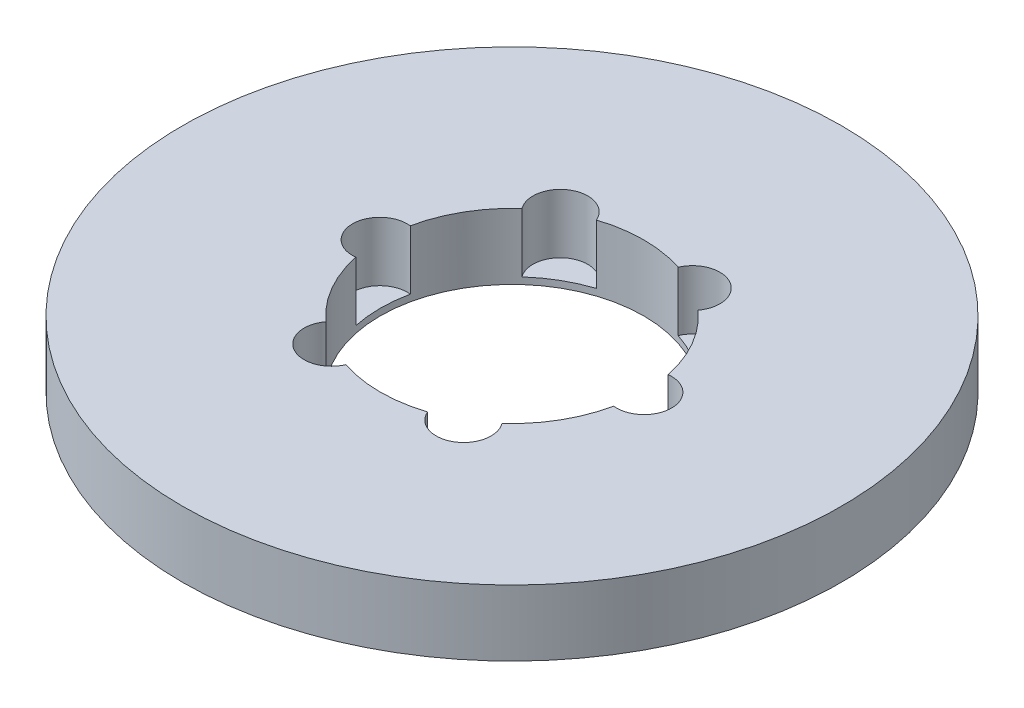
ISO-10303-21;
HEADER;
FILE_DESCRIPTION(('STEP AP214'),'2;1');
FILE_NAME('part.step','',(''),(''),'','','');
FILE_SCHEMA(('AUTOMOTIVE_DESIGN { 1 0 10303 214 1 1 1 1 }'));
ENDSEC;
DATA;
#1=APPLICATION_CONTEXT('core data for automotive mechanical design processes');
#2=APPLICATION_PROTOCOL_DEFINITION('international standard','automotive_design',2000,#1);
#3=PRODUCT_CONTEXT('',#1,'mechanical');
#4=PRODUCT('Part','Part','',(#3));
#5=PRODUCT_RELATED_PRODUCT_CATEGORY('part','',(#4));
#6=PRODUCT_DEFINITION_FORMATION('','',#4);
#7=PRODUCT_DEFINITION_CONTEXT('part definition',#1,'design');
#8=PRODUCT_DEFINITION('design','',#6,#7);
#9=PRODUCT_DEFINITION_SHAPE('','',#8);
#10=(LENGTH_UNIT() NAMED_UNIT(*) SI_UNIT(.MILLI.,.METRE.));
#11=(NAMED_UNIT(*) PLANE_ANGLE_UNIT() SI_UNIT($,.RADIAN.));
#12=(NAMED_UNIT(*) SI_UNIT($,.STERADIAN.) SOLID_ANGLE_UNIT());
#13=UNCERTAINTY_MEASURE_WITH_UNIT(LENGTH_MEASURE(1.E-05),#10,'distance_accuracy_value','');
#14=(GEOMETRIC_REPRESENTATION_CONTEXT(3) GLOBAL_UNCERTAINTY_ASSIGNED_CONTEXT((#13)) GLOBAL_UNIT_ASSIGNED_CONTEXT((#10,
#11,#12)) REPRESENTATION_CONTEXT('',''));
#15=CARTESIAN_POINT('',(0.,0.,0.));
#16=DIRECTION('',(0.,0.,1.));
#17=DIRECTION('',(1.,0.,0.));
#18=AXIS2_PLACEMENT_3D('',#15,#16,#17);
#19=CARTESIAN_POINT('',(0.,15.,0.));
#20=DIRECTION('',(0.,-1.,0.));
#21=DIRECTION('',(0.,0.,-1.));
#22=AXIS2_PLACEMENT_3D('',#19,#20,#21);
#23=CYLINDRICAL_SURFACE('',#22,75.);
#24=CARTESIAN_POINT('',(0.,15.,0.));
#25=DIRECTION('',(0.,1.,0.));
#26=DIRECTION('',(0.,0.,1.));
#27=AXIS2_PLACEMENT_3D('',#24,#25,#26);
#28=CIRCLE('',#27,75.);
#29=CARTESIAN_POINT('',(0.,15.,75.));
#30=VERTEX_POINT('',#29);
#31=EDGE_CURVE('E171',#30,#30,#28,.T.);
#32=ORIENTED_EDGE('',*,*,#31,.F.);
#33=EDGE_LOOP('',(#32));
#34=FACE_BOUND('',#33,.T.);
#35=CARTESIAN_POINT('',(0.,0.,0.));
#36=DIRECTION('',(0.,1.,0.));
#37=DIRECTION('',(0.,0.,1.));
#38=AXIS2_PLACEMENT_3D('',#35,#36,#37);
#39=CIRCLE('',#38,75.);
#40=CARTESIAN_POINT('',(0.,0.,75.));
#41=VERTEX_POINT('',#40);
#42=EDGE_CURVE('E157',#41,#41,#39,.T.);
#43=ORIENTED_EDGE('',*,*,#42,.T.);
#44=EDGE_LOOP('',(#43));
#45=FACE_BOUND('',#44,.T.);
#46=ADVANCED_FACE('F39',(#34,#45),#23,.T.);
#47=CARTESIAN_POINT('',(0.,15.,0.));
#48=DIRECTION('',(0.,1.,0.));
#49=DIRECTION('',(0.,0.,1.));
#50=AXIS2_PLACEMENT_3D('',#47,#48,#49);
#51=PLANE('',#50);
#52=CARTESIAN_POINT('',(-15.0317045543741,15.,-26.0356760125397));
#53=DIRECTION('',(0.,1.,0.));
#54=DIRECTION('',(-0.866025403784433,0.,0.50000000000001));
#55=AXIS2_PLACEMENT_3D('',#52,#53,#54);
#56=CIRCLE('',#55,6.24633584145181);
#57=CARTESIAN_POINT('',(-9.30137681088265,15.,-28.5216477332915));
#58=VERTEX_POINT('',#57);
#59=CARTESIAN_POINT('',(-20.0497830893805,15.,-22.3160524750412));
#60=VERTEX_POINT('',#59);
#61=EDGE_CURVE('E214',#58,#60,#56,.T.);
#62=ORIENTED_EDGE('',*,*,#61,.F.);
#63=CARTESIAN_POINT('',(0.,15.,0.));
#64=DIRECTION('',(0.,1.,0.));
#65=DIRECTION('',(0.,0.,1.));
#66=AXIS2_PLACEMENT_3D('',#63,#64,#65);
#67=CIRCLE('',#66,30.);
#68=CARTESIAN_POINT('',(9.30137681088206,15.,-28.5216477332917));
#69=VERTEX_POINT('',#68);
#70=EDGE_CURVE('E272',#69,#58,#67,.T.);
#71=ORIENTED_EDGE('',*,*,#70,.F.);
#72=CARTESIAN_POINT('',(15.0317045543736,15.,-26.0356760125401));
#73=DIRECTION('',(0.,1.,0.));
#74=DIRECTION('',(-0.866025403784443,0.,-0.499999999999992));
#75=AXIS2_PLACEMENT_3D('',#72,#73,#74);
#76=CIRCLE('',#75,6.24633584145181);
#77=CARTESIAN_POINT('',(20.04978308938,15.,-22.3160524750416));
#78=VERTEX_POINT('',#77);
#79=EDGE_CURVE('E285',#78,#69,#76,.T.);
#80=ORIENTED_EDGE('',*,*,#79,.F.);
#81=CARTESIAN_POINT('',(29.3511599002626,15.,-6.20559525825025));
#82=VERTEX_POINT('',#81);
#83=EDGE_CURVE('E165',#82,#78,#67,.T.);
#84=ORIENTED_EDGE('',*,*,#83,.F.);
#85=CARTESIAN_POINT('',(30.0634091087476,15.,0.));
#86=DIRECTION('',(0.,1.,0.));
#87=DIRECTION('',(0.,0.,-1.));
#88=AXIS2_PLACEMENT_3D('',#85,#86,#87);
#89=CIRCLE('',#88,6.24633584145181);
#90=CARTESIAN_POINT('',(29.3511599002626,15.,6.20559525825025));
#91=VERTEX_POINT('',#90);
#92=EDGE_CURVE('E281',#91,#82,#89,.T.);
#93=ORIENTED_EDGE('',*,*,#92,.F.);
#94=CARTESIAN_POINT('',(20.0497830893804,15.,22.3160524750413));
#95=VERTEX_POINT('',#94);
#96=EDGE_CURVE('E160',#95,#91,#67,.T.);
#97=ORIENTED_EDGE('',*,*,#96,.F.);
#98=CARTESIAN_POINT('',(15.0317045543739,15.,26.0356760125399));
#99=DIRECTION('',(0.,1.,0.));
#100=DIRECTION('',(0.866025403784436,0.,-0.500000000000004));
#101=AXIS2_PLACEMENT_3D('',#98,#99,#100);
#102=CIRCLE('',#101,6.24633584145181);
#103=CARTESIAN_POINT('',(9.30137681088245,15.,28.5216477332916));
#104=VERTEX_POINT('',#103);
#105=EDGE_CURVE('E154',#104,#95,#102,.T.);
#106=ORIENTED_EDGE('',*,*,#105,.F.);
#107=CARTESIAN_POINT('',(-9.30137681088225,15.,28.5216477332917));
#108=VERTEX_POINT('',#107);
#109=EDGE_CURVE('E150',#108,#104,#67,.T.);
#110=ORIENTED_EDGE('',*,*,#109,.F.);
#111=CARTESIAN_POINT('',(-15.0317045543737,15.,26.03567601254));
#112=DIRECTION('',(0.,1.,0.));
#113=DIRECTION('',(0.86602540378444,0.,0.499999999999998));
#114=AXIS2_PLACEMENT_3D('',#111,#112,#113);
#115=CIRCLE('',#114,6.24633584145181);
#116=CARTESIAN_POINT('',(-20.0497830893802,15.,22.3160524750414));
#117=VERTEX_POINT('',#116);
#118=EDGE_CURVE('E127',#117,#108,#115,.T.);
#119=ORIENTED_EDGE('',*,*,#118,.F.);
#120=CARTESIAN_POINT('',(-29.3511599002626,15.,6.20559525825025));
#121=VERTEX_POINT('',#120);
#122=EDGE_CURVE('E156',#121,#117,#67,.T.);
#123=ORIENTED_EDGE('',*,*,#122,.F.);
#124=CARTESIAN_POINT('',(-30.0634091087476,15.,0.));
#125=DIRECTION('',(0.,1.,0.));
#126=DIRECTION('',(0.,0.,1.));
#127=AXIS2_PLACEMENT_3D('',#124,#125,#126);
#128=CIRCLE('',#127,6.24633584145181);
#129=CARTESIAN_POINT('',(-29.3511599002626,15.,-6.20559525825025));
#130=VERTEX_POINT('',#129);
#131=EDGE_CURVE('E164',#130,#121,#128,.T.);
#132=ORIENTED_EDGE('',*,*,#131,.F.);
#133=EDGE_CURVE('E159',#60,#130,#67,.T.);
#134=ORIENTED_EDGE('',*,*,#133,.F.);
#135=EDGE_LOOP('',(#62,#71,#80,#84,#93,#97,#106,#110,#119,#123,#132,#134));
#136=FACE_BOUND('',#135,.T.);
#137=ORIENTED_EDGE('',*,*,#31,.T.);
#138=EDGE_LOOP('',(#137));
#139=FACE_BOUND('',#138,.T.);
#140=ADVANCED_FACE('F155',(#136,#139),#51,.T.);
#141=CARTESIAN_POINT('',(0.,0.,0.));
#142=DIRECTION('',(0.,1.,0.));
#143=DIRECTION('',(0.,0.,1.));
#144=AXIS2_PLACEMENT_3D('',#141,#142,#143);
#145=PLANE('',#144);
#146=CARTESIAN_POINT('',(0.,0.,0.));
#147=DIRECTION('',(0.,1.,0.));
#148=DIRECTION('',(0.,0.,1.));
#149=AXIS2_PLACEMENT_3D('',#146,#147,#148);
#150=CIRCLE('',#149,30.);
#151=CARTESIAN_POINT('',(0.,0.,30.));
#152=VERTEX_POINT('',#151);
#153=EDGE_CURVE('E170',#152,#152,#150,.T.);
#154=ORIENTED_EDGE('',*,*,#153,.T.);
#155=EDGE_LOOP('',(#154));
#156=FACE_BOUND('',#155,.T.);
#157=ORIENTED_EDGE('',*,*,#42,.F.);
#158=EDGE_LOOP('',(#157));
#159=FACE_BOUND('',#158,.T.);
#160=ADVANCED_FACE('F232',(#156,#159),#145,.F.);
#161=CARTESIAN_POINT('',(0.,15.,0.));
#162=DIRECTION('',(0.,-1.,0.));
#163=DIRECTION('',(0.,0.,-1.));
#164=AXIS2_PLACEMENT_3D('',#161,#162,#163);
#165=CYLINDRICAL_SURFACE('',#164,30.);
#166=DIRECTION('',(0.,1.,0.));
#167=VECTOR('',#166,1.);
#168=CARTESIAN_POINT('',(-9.30137681088265,8.25850928202004,-28.5216477332915));
#169=LINE('',#168,#167);
#170=CARTESIAN_POINT('',(-9.30137681088265,1.51701856404009,-28.5216477332915));
#171=VERTEX_POINT('',#170);
#172=EDGE_CURVE('E11',#171,#58,#169,.T.);
#173=ORIENTED_EDGE('',*,*,#172,.F.);
#174=CARTESIAN_POINT('',(0.,1.51701856404009,0.));
#175=DIRECTION('',(0.,1.,0.));
#176=DIRECTION('',(0.,0.,1.));
#177=AXIS2_PLACEMENT_3D('',#174,#175,#176);
#178=CIRCLE('',#177,30.);
#179=CARTESIAN_POINT('',(-20.0497830893805,1.51701856404009,-22.3160524750412));
#180=VERTEX_POINT('',#179);
#181=EDGE_CURVE('E209',#171,#180,#178,.T.);
#182=ORIENTED_EDGE('',*,*,#181,.T.);
#183=DIRECTION('',(0.,1.,0.));
#184=VECTOR('',#183,1.);
#185=CARTESIAN_POINT('',(-20.0497830893805,8.25850928202004,-22.3160524750412));
#186=LINE('',#185,#184);
#187=EDGE_CURVE('E46',#60,#180,#186,.F.);
#188=ORIENTED_EDGE('',*,*,#187,.F.);
#189=ORIENTED_EDGE('',*,*,#133,.T.);
#190=DIRECTION('',(0.,1.,0.));
#191=VECTOR('',#190,1.);
#192=CARTESIAN_POINT('',(-29.3511599002626,8.25850928202004,-6.20559525825025));
#193=LINE('',#192,#191);
#194=CARTESIAN_POINT('',(-29.3511599002626,1.51701856404009,-6.20559525825025));
#195=VERTEX_POINT('',#194);
#196=EDGE_CURVE('E185',#195,#130,#193,.T.);
#197=ORIENTED_EDGE('',*,*,#196,.F.);
#198=CARTESIAN_POINT('',(0.,1.51701856404009,0.));
#199=DIRECTION('',(0.,1.,0.));
#200=DIRECTION('',(0.,0.,1.));
#201=AXIS2_PLACEMENT_3D('',#198,#199,#200);
#202=CIRCLE('',#201,30.);
#203=CARTESIAN_POINT('',(-29.3511599002626,1.51701856404009,6.20559525825025));
#204=VERTEX_POINT('',#203);
#205=EDGE_CURVE('E173',#195,#204,#202,.T.);
#206=ORIENTED_EDGE('',*,*,#205,.T.);
#207=DIRECTION('',(0.,1.,0.));
#208=VECTOR('',#207,1.);
#209=CARTESIAN_POINT('',(-29.3511599002626,8.25850928202004,6.20559525825025));
#210=LINE('',#209,#208);
#211=EDGE_CURVE('E178',#121,#204,#210,.F.);
#212=ORIENTED_EDGE('',*,*,#211,.F.);
#213=ORIENTED_EDGE('',*,*,#122,.T.);
#214=DIRECTION('',(0.,1.,0.));
#215=VECTOR('',#214,1.);
#216=CARTESIAN_POINT('',(-20.0497830893802,8.25850928202004,22.3160524750414));
#217=LINE('',#216,#215);
#218=CARTESIAN_POINT('',(-20.0497830893802,1.51701856404009,22.3160524750414));
#219=VERTEX_POINT('',#218);
#220=EDGE_CURVE('E132',#219,#117,#217,.T.);
#221=ORIENTED_EDGE('',*,*,#220,.F.);
#222=CARTESIAN_POINT('',(0.,1.51701856404009,0.));
#223=DIRECTION('',(0.,1.,0.));
#224=DIRECTION('',(0.,0.,1.));
#225=AXIS2_PLACEMENT_3D('',#222,#223,#224);
#226=CIRCLE('',#225,30.);
#227=CARTESIAN_POINT('',(-9.30137681088225,1.51701856404009,28.5216477332917));
#228=VERTEX_POINT('',#227);
#229=EDGE_CURVE('E146',#219,#228,#226,.T.);
#230=ORIENTED_EDGE('',*,*,#229,.T.);
#231=DIRECTION('',(0.,1.,0.));
#232=VECTOR('',#231,1.);
#233=CARTESIAN_POINT('',(-9.30137681088225,8.25850928202004,28.5216477332917));
#234=LINE('',#233,#232);
#235=EDGE_CURVE('E128',#108,#228,#234,.F.);
#236=ORIENTED_EDGE('',*,*,#235,.F.);
#237=ORIENTED_EDGE('',*,*,#109,.T.);
#238=DIRECTION('',(0.,1.,0.));
#239=VECTOR('',#238,1.);
#240=CARTESIAN_POINT('',(9.30137681088245,8.25850928202004,28.5216477332916));
#241=LINE('',#240,#239);
#242=CARTESIAN_POINT('',(9.30137681088245,1.51701856404009,28.5216477332916));
#243=VERTEX_POINT('',#242);
#244=EDGE_CURVE('E192',#243,#104,#241,.T.);
#245=ORIENTED_EDGE('',*,*,#244,.F.);
#246=CARTESIAN_POINT('',(0.,1.51701856404009,0.));
#247=DIRECTION('',(0.,1.,0.));
#248=DIRECTION('',(0.,0.,1.));
#249=AXIS2_PLACEMENT_3D('',#246,#247,#248);
#250=CIRCLE('',#249,30.);
#251=CARTESIAN_POINT('',(20.0497830893804,1.51701856404009,22.3160524750413));
#252=VERTEX_POINT('',#251);
#253=EDGE_CURVE('E190',#243,#252,#250,.T.);
#254=ORIENTED_EDGE('',*,*,#253,.T.);
#255=DIRECTION('',(0.,1.,0.));
#256=VECTOR('',#255,1.);
#257=CARTESIAN_POINT('',(20.0497830893804,8.25850928202004,22.3160524750413));
#258=LINE('',#257,#256);
#259=EDGE_CURVE('E189',#95,#252,#258,.F.);
#260=ORIENTED_EDGE('',*,*,#259,.F.);
#261=ORIENTED_EDGE('',*,*,#96,.T.);
#262=DIRECTION('',(0.,1.,0.));
#263=VECTOR('',#262,1.);
#264=CARTESIAN_POINT('',(29.3511599002626,8.25850928202004,6.20559525825025));
#265=LINE('',#264,#263);
#266=CARTESIAN_POINT('',(29.3511599002626,1.51701856404009,6.20559525825025));
#267=VERTEX_POINT('',#266);
#268=EDGE_CURVE('E203',#267,#91,#265,.T.);
#269=ORIENTED_EDGE('',*,*,#268,.F.);
#270=CARTESIAN_POINT('',(0.,1.51701856404009,0.));
#271=DIRECTION('',(0.,1.,0.));
#272=DIRECTION('',(0.,0.,1.));
#273=AXIS2_PLACEMENT_3D('',#270,#271,#272);
#274=CIRCLE('',#273,30.);
#275=CARTESIAN_POINT('',(29.3511599002626,1.51701856404009,-6.20559525825025));
#276=VERTEX_POINT('',#275);
#277=EDGE_CURVE('E194',#267,#276,#274,.T.);
#278=ORIENTED_EDGE('',*,*,#277,.T.);
#279=DIRECTION('',(0.,1.,0.));
#280=VECTOR('',#279,1.);
#281=CARTESIAN_POINT('',(29.3511599002626,8.25850928202004,-6.20559525825025));
#282=LINE('',#281,#280);
#283=EDGE_CURVE('E196',#82,#276,#282,.F.);
#284=ORIENTED_EDGE('',*,*,#283,.F.);
#285=ORIENTED_EDGE('',*,*,#83,.T.);
#286=DIRECTION('',(0.,1.,0.));
#287=VECTOR('',#286,1.);
#288=CARTESIAN_POINT('',(20.04978308938,8.25850928202004,-22.3160524750416));
#289=LINE('',#288,#287);
#290=CARTESIAN_POINT('',(20.04978308938,1.51701856404009,-22.3160524750416));
#291=VERTEX_POINT('',#290);
#292=EDGE_CURVE('E208',#291,#78,#289,.T.);
#293=ORIENTED_EDGE('',*,*,#292,.F.);
#294=CARTESIAN_POINT('',(0.,1.51701856404009,0.));
#295=DIRECTION('',(0.,1.,0.));
#296=DIRECTION('',(0.,0.,1.));
#297=AXIS2_PLACEMENT_3D('',#294,#295,#296);
#298=CIRCLE('',#297,30.);
#299=CARTESIAN_POINT('',(9.30137681088206,1.51701856404009,-28.5216477332917));
#300=VERTEX_POINT('',#299);
#301=EDGE_CURVE('E201',#291,#300,#298,.T.);
#302=ORIENTED_EDGE('',*,*,#301,.T.);
#303=DIRECTION('',(0.,1.,0.));
#304=VECTOR('',#303,1.);
#305=CARTESIAN_POINT('',(9.30137681088206,8.25850928202004,-28.5216477332917));
#306=LINE('',#305,#304);
#307=EDGE_CURVE('E206',#69,#300,#306,.F.);
#308=ORIENTED_EDGE('',*,*,#307,.F.);
#309=ORIENTED_EDGE('',*,*,#70,.T.);
#310=EDGE_LOOP('',(#173,#182,#188,#189,#197,#206,#212,#213,#221,#230,#236,#237,#245,#254,#260,
#261,#269,#278,#284,#285,#293,#302,#308,#309));
#311=FACE_BOUND('',#310,.T.);
#312=ORIENTED_EDGE('',*,*,#153,.F.);
#313=EDGE_LOOP('',(#312));
#314=FACE_BOUND('',#313,.T.);
#315=ADVANCED_FACE('F145',(#311,#314),#165,.F.);
#316=CARTESIAN_POINT('',(-30.0634091087476,1.51701856404009,0.));
#317=DIRECTION('',(0.,1.,0.));
#318=DIRECTION('',(0.,0.,1.));
#319=AXIS2_PLACEMENT_3D('',#316,#317,#318);
#320=CYLINDRICAL_SURFACE('',#319,6.24633584145181);
#321=ORIENTED_EDGE('',*,*,#196,.T.);
#322=ORIENTED_EDGE('',*,*,#131,.T.);
#323=ORIENTED_EDGE('',*,*,#211,.T.);
#324=CARTESIAN_POINT('',(-30.0634091087476,1.51701856404009,0.));
#325=DIRECTION('',(0.,1.,0.));
#326=DIRECTION('',(0.,0.,1.));
#327=AXIS2_PLACEMENT_3D('',#324,#325,#326);
#328=CIRCLE('',#327,6.24633584145181);
#329=EDGE_CURVE('E168',#195,#204,#328,.T.);
#330=ORIENTED_EDGE('',*,*,#329,.F.);
#331=EDGE_LOOP('',(#321,#322,#323,#330));
#332=FACE_BOUND('',#331,.T.);
#333=ADVANCED_FACE('F243',(#332),#320,.F.);
#334=CARTESIAN_POINT('',(-30.0634091087476,1.51701856404009,0.));
#335=DIRECTION('',(0.,1.,0.));
#336=DIRECTION('',(0.,0.,1.));
#337=AXIS2_PLACEMENT_3D('',#334,#335,#336);
#338=PLANE('',#337);
#339=ORIENTED_EDGE('',*,*,#329,.T.);
#340=ORIENTED_EDGE('',*,*,#205,.F.);
#341=EDGE_LOOP('',(#339,#340));
#342=FACE_BOUND('',#341,.T.);
#343=ADVANCED_FACE('F247',(#342),#338,.T.);
#344=CARTESIAN_POINT('',(-15.0317045543737,1.51701856404009,26.03567601254));
#345=DIRECTION('',(0.,1.,0.));
#346=DIRECTION('',(0.,0.,1.));
#347=AXIS2_PLACEMENT_3D('',#344,#345,#346);
#348=CYLINDRICAL_SURFACE('',#347,6.24633584145181);
#349=ORIENTED_EDGE('',*,*,#220,.T.);
#350=ORIENTED_EDGE('',*,*,#118,.T.);
#351=ORIENTED_EDGE('',*,*,#235,.T.);
#352=CARTESIAN_POINT('',(-15.0317045543737,1.51701856404009,26.03567601254));
#353=DIRECTION('',(0.,1.,0.));
#354=DIRECTION('',(0.86602540378444,0.,0.499999999999998));
#355=AXIS2_PLACEMENT_3D('',#352,#353,#354);
#356=CIRCLE('',#355,6.24633584145181);
#357=EDGE_CURVE('E137',#219,#228,#356,.T.);
#358=ORIENTED_EDGE('',*,*,#357,.F.);
#359=EDGE_LOOP('',(#349,#350,#351,#358));
#360=FACE_BOUND('',#359,.T.);
#361=ADVANCED_FACE('F126',(#360),#348,.F.);
#362=CARTESIAN_POINT('',(-15.0317045543737,1.51701856404009,26.03567601254));
#363=DIRECTION('',(0.,1.,0.));
#364=DIRECTION('',(0.86602540378444,0.,0.499999999999998));
#365=AXIS2_PLACEMENT_3D('',#362,#363,#364);
#366=PLANE('',#365);
#367=ORIENTED_EDGE('',*,*,#357,.T.);
#368=ORIENTED_EDGE('',*,*,#229,.F.);
#369=EDGE_LOOP('',(#367,#368));
#370=FACE_BOUND('',#369,.T.);
#371=ADVANCED_FACE('F254',(#370),#366,.T.);
#372=CARTESIAN_POINT('',(15.0317045543739,1.51701856404009,26.0356760125399));
#373=DIRECTION('',(0.,1.,0.));
#374=DIRECTION('',(0.,0.,1.));
#375=AXIS2_PLACEMENT_3D('',#372,#373,#374);
#376=CYLINDRICAL_SURFACE('',#375,6.24633584145181);
#377=ORIENTED_EDGE('',*,*,#244,.T.);
#378=ORIENTED_EDGE('',*,*,#105,.T.);
#379=ORIENTED_EDGE('',*,*,#259,.T.);
#380=CARTESIAN_POINT('',(15.0317045543739,1.51701856404009,26.0356760125399));
#381=DIRECTION('',(0.,1.,0.));
#382=DIRECTION('',(0.866025403784436,0.,-0.500000000000004));
#383=AXIS2_PLACEMENT_3D('',#380,#381,#382);
#384=CIRCLE('',#383,6.24633584145181);
#385=EDGE_CURVE('E138',#243,#252,#384,.T.);
#386=ORIENTED_EDGE('',*,*,#385,.F.);
#387=EDGE_LOOP('',(#377,#378,#379,#386));
#388=FACE_BOUND('',#387,.T.);
#389=ADVANCED_FACE('F260',(#388),#376,.F.);
#390=CARTESIAN_POINT('',(15.0317045543739,1.51701856404009,26.0356760125399));
#391=DIRECTION('',(0.,1.,0.));
#392=DIRECTION('',(0.866025403784436,0.,-0.500000000000004));
#393=AXIS2_PLACEMENT_3D('',#390,#391,#392);
#394=PLANE('',#393);
#395=ORIENTED_EDGE('',*,*,#385,.T.);
#396=ORIENTED_EDGE('',*,*,#253,.F.);
#397=EDGE_LOOP('',(#395,#396));
#398=FACE_BOUND('',#397,.T.);
#399=ADVANCED_FACE('F265',(#398),#394,.T.);
#400=CARTESIAN_POINT('',(30.0634091087476,1.51701856404009,0.));
#401=DIRECTION('',(0.,1.,0.));
#402=DIRECTION('',(0.,0.,1.));
#403=AXIS2_PLACEMENT_3D('',#400,#401,#402);
#404=CYLINDRICAL_SURFACE('',#403,6.24633584145181);
#405=ORIENTED_EDGE('',*,*,#268,.T.);
#406=ORIENTED_EDGE('',*,*,#92,.T.);
#407=ORIENTED_EDGE('',*,*,#283,.T.);
#408=CARTESIAN_POINT('',(30.0634091087476,1.51701856404009,0.));
#409=DIRECTION('',(0.,1.,0.));
#410=DIRECTION('',(0.,0.,-1.));
#411=AXIS2_PLACEMENT_3D('',#408,#409,#410);
#412=CIRCLE('',#411,6.24633584145181);
#413=EDGE_CURVE('E287',#267,#276,#412,.T.);
#414=ORIENTED_EDGE('',*,*,#413,.F.);
#415=EDGE_LOOP('',(#405,#406,#407,#414));
#416=FACE_BOUND('',#415,.T.);
#417=ADVANCED_FACE('F300',(#416),#404,.F.);
#418=CARTESIAN_POINT('',(30.0634091087476,1.51701856404009,0.));
#419=DIRECTION('',(0.,1.,0.));
#420=DIRECTION('',(0.,0.,-1.));
#421=AXIS2_PLACEMENT_3D('',#418,#419,#420);
#422=PLANE('',#421);
#423=ORIENTED_EDGE('',*,*,#413,.T.);
#424=ORIENTED_EDGE('',*,*,#277,.F.);
#425=EDGE_LOOP('',(#423,#424));
#426=FACE_BOUND('',#425,.T.);
#427=ADVANCED_FACE('F298',(#426),#422,.T.);
#428=CARTESIAN_POINT('',(15.0317045543736,1.51701856404009,-26.0356760125401));
#429=DIRECTION('',(0.,1.,0.));
#430=DIRECTION('',(0.,0.,1.));
#431=AXIS2_PLACEMENT_3D('',#428,#429,#430);
#432=CYLINDRICAL_SURFACE('',#431,6.24633584145181);
#433=ORIENTED_EDGE('',*,*,#292,.T.);
#434=ORIENTED_EDGE('',*,*,#79,.T.);
#435=ORIENTED_EDGE('',*,*,#307,.T.);
#436=CARTESIAN_POINT('',(15.0317045543736,1.51701856404009,-26.0356760125401));
#437=DIRECTION('',(0.,1.,0.));
#438=DIRECTION('',(-0.866025403784443,0.,-0.499999999999992));
#439=AXIS2_PLACEMENT_3D('',#436,#437,#438);
#440=CIRCLE('',#439,6.24633584145181);
#441=EDGE_CURVE('E56',#291,#300,#440,.T.);
#442=ORIENTED_EDGE('',*,*,#441,.F.);
#443=EDGE_LOOP('',(#433,#434,#435,#442));
#444=FACE_BOUND('',#443,.T.);
#445=ADVANCED_FACE('F301',(#444),#432,.F.);
#446=CARTESIAN_POINT('',(15.0317045543736,1.51701856404009,-26.0356760125401));
#447=DIRECTION('',(0.,1.,0.));
#448=DIRECTION('',(-0.866025403784443,0.,-0.499999999999992));
#449=AXIS2_PLACEMENT_3D('',#446,#447,#448);
#450=PLANE('',#449);
#451=ORIENTED_EDGE('',*,*,#441,.T.);
#452=ORIENTED_EDGE('',*,*,#301,.F.);
#453=EDGE_LOOP('',(#451,#452));
#454=FACE_BOUND('',#453,.T.);
#455=ADVANCED_FACE('F221',(#454),#450,.T.);
#456=CARTESIAN_POINT('',(-15.0317045543741,1.51701856404009,-26.0356760125397));
#457=DIRECTION('',(0.,1.,0.));
#458=DIRECTION('',(0.,0.,1.));
#459=AXIS2_PLACEMENT_3D('',#456,#457,#458);
#460=CYLINDRICAL_SURFACE('',#459,6.24633584145181);
#461=ORIENTED_EDGE('',*,*,#172,.T.);
#462=ORIENTED_EDGE('',*,*,#61,.T.);
#463=ORIENTED_EDGE('',*,*,#187,.T.);
#464=CARTESIAN_POINT('',(-15.0317045543741,1.51701856404009,-26.0356760125397));
#465=DIRECTION('',(0.,1.,0.));
#466=DIRECTION('',(-0.866025403784433,0.,0.50000000000001));
#467=AXIS2_PLACEMENT_3D('',#464,#465,#466);
#468=CIRCLE('',#467,6.24633584145181);
#469=EDGE_CURVE('E55',#171,#180,#468,.T.);
#470=ORIENTED_EDGE('',*,*,#469,.F.);
#471=EDGE_LOOP('',(#461,#462,#463,#470));
#472=FACE_BOUND('',#471,.T.);
#473=ADVANCED_FACE('F212',(#472),#460,.F.);
#474=CARTESIAN_POINT('',(-15.0317045543741,1.51701856404009,-26.0356760125397));
#475=DIRECTION('',(0.,1.,0.));
#476=DIRECTION('',(-0.866025403784433,0.,0.50000000000001));
#477=AXIS2_PLACEMENT_3D('',#474,#475,#476);
#478=PLANE('',#477);
#479=ORIENTED_EDGE('',*,*,#469,.T.);
#480=ORIENTED_EDGE('',*,*,#181,.F.);
#481=EDGE_LOOP('',(#479,#480));
#482=FACE_BOUND('',#481,.T.);
#483=ADVANCED_FACE('F217',(#482),#478,.T.);
#484=CLOSED_SHELL('',(#46,#140,#160,#315,#333,#343,#361,#371,#389,#399,#417,#427,#445,#455,#473,#483));
#485=MANIFOLD_SOLID_BREP('B2',#484);
#486=ADVANCED_BREP_SHAPE_REPRESENTATION('',(#18,#485),#14);
#487=SHAPE_DEFINITION_REPRESENTATION(#9,#486);
ENDSEC;
END-ISO-10303-21;
